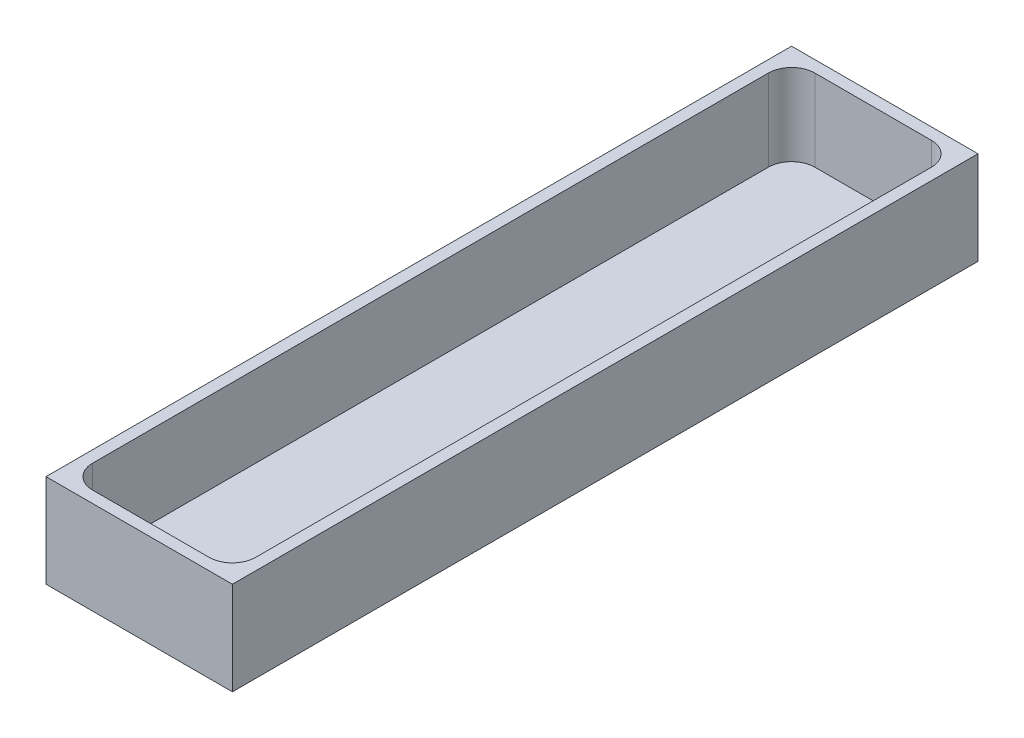
ISO-10303-21;
HEADER;
FILE_DESCRIPTION(('STEP AP214'),'2;1');
FILE_NAME('part.step','',(''),(''),'','','');
FILE_SCHEMA(('AUTOMOTIVE_DESIGN { 1 0 10303 214 1 1 1 1 }'));
ENDSEC;
DATA;
#1=APPLICATION_CONTEXT('core data for automotive mechanical design processes');
#2=APPLICATION_PROTOCOL_DEFINITION('international standard','automotive_design',2000,#1);
#3=PRODUCT_CONTEXT('',#1,'mechanical');
#4=PRODUCT('Part','Part','',(#3));
#5=PRODUCT_RELATED_PRODUCT_CATEGORY('part','',(#4));
#6=PRODUCT_DEFINITION_FORMATION('','',#4);
#7=PRODUCT_DEFINITION_CONTEXT('part definition',#1,'design');
#8=PRODUCT_DEFINITION('design','',#6,#7);
#9=PRODUCT_DEFINITION_SHAPE('','',#8);
#10=(LENGTH_UNIT() NAMED_UNIT(*) SI_UNIT(.MILLI.,.METRE.));
#11=(NAMED_UNIT(*) PLANE_ANGLE_UNIT() SI_UNIT($,.RADIAN.));
#12=(NAMED_UNIT(*) SI_UNIT($,.STERADIAN.) SOLID_ANGLE_UNIT());
#13=UNCERTAINTY_MEASURE_WITH_UNIT(LENGTH_MEASURE(1.E-05),#10,'distance_accuracy_value','');
#14=(GEOMETRIC_REPRESENTATION_CONTEXT(3) GLOBAL_UNCERTAINTY_ASSIGNED_CONTEXT((#13)) GLOBAL_UNIT_ASSIGNED_CONTEXT((#10,
#11,#12)) REPRESENTATION_CONTEXT('',''));
#15=CARTESIAN_POINT('',(0.,0.,0.));
#16=DIRECTION('',(0.,0.,1.));
#17=DIRECTION('',(1.,0.,0.));
#18=AXIS2_PLACEMENT_3D('',#15,#16,#17);
#19=CARTESIAN_POINT('',(0.,25.4,0.));
#20=DIRECTION('',(0.,-1.,0.));
#21=DIRECTION('',(0.,0.,-1.));
#22=AXIS2_PLACEMENT_3D('',#19,#20,#21);
#23=PLANE('',#22);
#24=DIRECTION('',(0.,0.,1.));
#25=VECTOR('',#24,1.);
#26=CARTESIAN_POINT('',(0.,25.4,0.));
#27=LINE('',#26,#25);
#28=CARTESIAN_POINT('',(0.,25.4,-203.2));
#29=VERTEX_POINT('',#28);
#30=CARTESIAN_POINT('',(0.,25.4,0.));
#31=VERTEX_POINT('',#30);
#32=EDGE_CURVE('E134',#29,#31,#27,.T.);
#33=ORIENTED_EDGE('',*,*,#32,.T.);
#34=DIRECTION('',(1.,0.,0.));
#35=VECTOR('',#34,1.);
#36=CARTESIAN_POINT('',(0.,25.4,0.));
#37=LINE('',#36,#35);
#38=CARTESIAN_POINT('',(50.8,25.4,0.));
#39=VERTEX_POINT('',#38);
#40=EDGE_CURVE('E123',#31,#39,#37,.T.);
#41=ORIENTED_EDGE('',*,*,#40,.T.);
#42=DIRECTION('',(0.,0.,-1.));
#43=VECTOR('',#42,1.);
#44=CARTESIAN_POINT('',(50.8,25.4,0.));
#45=LINE('',#44,#43);
#46=CARTESIAN_POINT('',(50.8,25.4,-203.2));
#47=VERTEX_POINT('',#46);
#48=EDGE_CURVE('E133',#39,#47,#45,.T.);
#49=ORIENTED_EDGE('',*,*,#48,.T.);
#50=DIRECTION('',(-1.,0.,0.));
#51=VECTOR('',#50,1.);
#52=CARTESIAN_POINT('',(0.,25.4,-203.2));
#53=LINE('',#52,#51);
#54=EDGE_CURVE('E138',#47,#29,#53,.T.);
#55=ORIENTED_EDGE('',*,*,#54,.T.);
#56=EDGE_LOOP('',(#33,#41,#49,#55));
#57=FACE_BOUND('',#56,.T.);
#58=DIRECTION('',(0.,0.,1.));
#59=VECTOR('',#58,1.);
#60=CARTESIAN_POINT('',(3.175,25.4,0.));
#61=LINE('',#60,#59);
#62=CARTESIAN_POINT('',(3.175,25.4,-193.675));
#63=VERTEX_POINT('',#62);
#64=CARTESIAN_POINT('',(3.175,25.4,-9.525));
#65=VERTEX_POINT('',#64);
#66=EDGE_CURVE('E206',#63,#65,#61,.T.);
#67=ORIENTED_EDGE('',*,*,#66,.F.);
#68=CARTESIAN_POINT('',(9.525,25.4,-193.675));
#69=DIRECTION('',(0.,-1.,0.));
#70=DIRECTION('',(0.,0.,-1.));
#71=AXIS2_PLACEMENT_3D('',#68,#69,#70);
#72=CIRCLE('',#71,6.35);
#73=CARTESIAN_POINT('',(9.525,25.4,-200.025));
#74=VERTEX_POINT('',#73);
#75=EDGE_CURVE('E11',#63,#74,#72,.T.);
#76=ORIENTED_EDGE('',*,*,#75,.T.);
#77=DIRECTION('',(-1.,0.,0.));
#78=VECTOR('',#77,1.);
#79=CARTESIAN_POINT('',(0.,25.4,-200.025));
#80=LINE('',#79,#78);
#81=CARTESIAN_POINT('',(41.275,25.4,-200.025));
#82=VERTEX_POINT('',#81);
#83=EDGE_CURVE('E187',#82,#74,#80,.T.);
#84=ORIENTED_EDGE('',*,*,#83,.F.);
#85=CARTESIAN_POINT('',(41.275,25.4,-193.675));
#86=DIRECTION('',(0.,-1.,0.));
#87=DIRECTION('',(0.,0.,-1.));
#88=AXIS2_PLACEMENT_3D('',#85,#86,#87);
#89=CIRCLE('',#88,6.35);
#90=CARTESIAN_POINT('',(47.625,25.4,-193.675));
#91=VERTEX_POINT('',#90);
#92=EDGE_CURVE('E42',#82,#91,#89,.T.);
#93=ORIENTED_EDGE('',*,*,#92,.T.);
#94=DIRECTION('',(0.,0.,-1.));
#95=VECTOR('',#94,1.);
#96=CARTESIAN_POINT('',(47.625,25.4,0.));
#97=LINE('',#96,#95);
#98=CARTESIAN_POINT('',(47.625,25.4,-9.525));
#99=VERTEX_POINT('',#98);
#100=EDGE_CURVE('E185',#99,#91,#97,.T.);
#101=ORIENTED_EDGE('',*,*,#100,.F.);
#102=CARTESIAN_POINT('',(41.275,25.4,-9.525));
#103=DIRECTION('',(0.,-1.,0.));
#104=DIRECTION('',(0.,0.,-1.));
#105=AXIS2_PLACEMENT_3D('',#102,#103,#104);
#106=CIRCLE('',#105,6.35);
#107=CARTESIAN_POINT('',(41.275,25.4,-3.175));
#108=VERTEX_POINT('',#107);
#109=EDGE_CURVE('E181',#99,#108,#106,.T.);
#110=ORIENTED_EDGE('',*,*,#109,.T.);
#111=DIRECTION('',(1.,0.,0.));
#112=VECTOR('',#111,1.);
#113=CARTESIAN_POINT('',(0.,25.4,-3.175));
#114=LINE('',#113,#112);
#115=CARTESIAN_POINT('',(9.525,25.4,-3.175));
#116=VERTEX_POINT('',#115);
#117=EDGE_CURVE('E195',#116,#108,#114,.T.);
#118=ORIENTED_EDGE('',*,*,#117,.F.);
#119=CARTESIAN_POINT('',(9.525,25.4,-9.525));
#120=DIRECTION('',(0.,-1.,0.));
#121=DIRECTION('',(0.,0.,-1.));
#122=AXIS2_PLACEMENT_3D('',#119,#120,#121);
#123=CIRCLE('',#122,6.35);
#124=EDGE_CURVE('E179',#116,#65,#123,.T.);
#125=ORIENTED_EDGE('',*,*,#124,.T.);
#126=EDGE_LOOP('',(#67,#76,#84,#93,#101,#110,#118,#125));
#127=FACE_BOUND('',#126,.T.);
#128=ADVANCED_FACE('F34',(#57,#127),#23,.F.);
#129=CARTESIAN_POINT('',(0.,25.4,0.));
#130=DIRECTION('',(1.,0.,0.));
#131=DIRECTION('',(0.,0.,-1.));
#132=AXIS2_PLACEMENT_3D('',#129,#130,#131);
#133=PLANE('',#132);
#134=DIRECTION('',(0.,0.,1.));
#135=VECTOR('',#134,1.);
#136=CARTESIAN_POINT('',(0.,0.,0.));
#137=LINE('',#136,#135);
#138=CARTESIAN_POINT('',(0.,0.,-203.2));
#139=VERTEX_POINT('',#138);
#140=CARTESIAN_POINT('',(0.,0.,0.));
#141=VERTEX_POINT('',#140);
#142=EDGE_CURVE('E146',#139,#141,#137,.T.);
#143=ORIENTED_EDGE('',*,*,#142,.T.);
#144=DIRECTION('',(0.,-1.,0.));
#145=VECTOR('',#144,1.);
#146=CARTESIAN_POINT('',(0.,25.4,0.));
#147=LINE('',#146,#145);
#148=EDGE_CURVE('E127',#31,#141,#147,.T.);
#149=ORIENTED_EDGE('',*,*,#148,.F.);
#150=ORIENTED_EDGE('',*,*,#32,.F.);
#151=DIRECTION('',(0.,-1.,0.));
#152=VECTOR('',#151,1.);
#153=CARTESIAN_POINT('',(0.,25.4,-203.2));
#154=LINE('',#153,#152);
#155=EDGE_CURVE('E219',#29,#139,#154,.T.);
#156=ORIENTED_EDGE('',*,*,#155,.T.);
#157=EDGE_LOOP('',(#143,#149,#150,#156));
#158=FACE_BOUND('',#157,.T.);
#159=ADVANCED_FACE('F144',(#158),#133,.F.);
#160=CARTESIAN_POINT('',(0.,25.4,0.));
#161=DIRECTION('',(0.,0.,-1.));
#162=DIRECTION('',(-1.,0.,0.));
#163=AXIS2_PLACEMENT_3D('',#160,#161,#162);
#164=PLANE('',#163);
#165=DIRECTION('',(1.,0.,0.));
#166=VECTOR('',#165,1.);
#167=CARTESIAN_POINT('',(0.,0.,0.));
#168=LINE('',#167,#166);
#169=CARTESIAN_POINT('',(50.8,0.,0.));
#170=VERTEX_POINT('',#169);
#171=EDGE_CURVE('E221',#141,#170,#168,.T.);
#172=ORIENTED_EDGE('',*,*,#171,.T.);
#173=DIRECTION('',(0.,-1.,0.));
#174=VECTOR('',#173,1.);
#175=CARTESIAN_POINT('',(50.8,25.4,0.));
#176=LINE('',#175,#174);
#177=EDGE_CURVE('E130',#39,#170,#176,.T.);
#178=ORIENTED_EDGE('',*,*,#177,.F.);
#179=ORIENTED_EDGE('',*,*,#40,.F.);
#180=ORIENTED_EDGE('',*,*,#148,.T.);
#181=EDGE_LOOP('',(#172,#178,#179,#180));
#182=FACE_BOUND('',#181,.T.);
#183=ADVANCED_FACE('F125',(#182),#164,.F.);
#184=CARTESIAN_POINT('',(50.8,25.4,0.));
#185=DIRECTION('',(-1.,0.,0.));
#186=DIRECTION('',(0.,0.,1.));
#187=AXIS2_PLACEMENT_3D('',#184,#185,#186);
#188=PLANE('',#187);
#189=DIRECTION('',(0.,0.,-1.));
#190=VECTOR('',#189,1.);
#191=CARTESIAN_POINT('',(50.8,0.,0.));
#192=LINE('',#191,#190);
#193=CARTESIAN_POINT('',(50.8,0.,-203.2));
#194=VERTEX_POINT('',#193);
#195=EDGE_CURVE('E223',#170,#194,#192,.T.);
#196=ORIENTED_EDGE('',*,*,#195,.T.);
#197=DIRECTION('',(0.,-1.,0.));
#198=VECTOR('',#197,1.);
#199=CARTESIAN_POINT('',(50.8,25.4,-203.2));
#200=LINE('',#199,#198);
#201=EDGE_CURVE('E151',#47,#194,#200,.T.);
#202=ORIENTED_EDGE('',*,*,#201,.F.);
#203=ORIENTED_EDGE('',*,*,#48,.F.);
#204=ORIENTED_EDGE('',*,*,#177,.T.);
#205=EDGE_LOOP('',(#196,#202,#203,#204));
#206=FACE_BOUND('',#205,.T.);
#207=ADVANCED_FACE('F235',(#206),#188,.F.);
#208=CARTESIAN_POINT('',(0.,25.4,-203.2));
#209=DIRECTION('',(0.,0.,1.));
#210=DIRECTION('',(1.,0.,0.));
#211=AXIS2_PLACEMENT_3D('',#208,#209,#210);
#212=PLANE('',#211);
#213=DIRECTION('',(-1.,0.,0.));
#214=VECTOR('',#213,1.);
#215=CARTESIAN_POINT('',(0.,0.,-203.2));
#216=LINE('',#215,#214);
#217=EDGE_CURVE('E142',#194,#139,#216,.T.);
#218=ORIENTED_EDGE('',*,*,#217,.T.);
#219=ORIENTED_EDGE('',*,*,#155,.F.);
#220=ORIENTED_EDGE('',*,*,#54,.F.);
#221=ORIENTED_EDGE('',*,*,#201,.T.);
#222=EDGE_LOOP('',(#218,#219,#220,#221));
#223=FACE_BOUND('',#222,.T.);
#224=ADVANCED_FACE('F230',(#223),#212,.F.);
#225=CARTESIAN_POINT('',(0.,0.,0.));
#226=DIRECTION('',(0.,-1.,0.));
#227=DIRECTION('',(0.,0.,-1.));
#228=AXIS2_PLACEMENT_3D('',#225,#226,#227);
#229=PLANE('',#228);
#230=ORIENTED_EDGE('',*,*,#142,.F.);
#231=ORIENTED_EDGE('',*,*,#217,.F.);
#232=ORIENTED_EDGE('',*,*,#195,.F.);
#233=ORIENTED_EDGE('',*,*,#171,.F.);
#234=EDGE_LOOP('',(#230,#231,#232,#233));
#235=FACE_BOUND('',#234,.T.);
#236=ADVANCED_FACE('F234',(#235),#229,.T.);
#237=CARTESIAN_POINT('',(3.175,25.4,0.));
#238=DIRECTION('',(1.,0.,0.));
#239=DIRECTION('',(0.,0.,-1.));
#240=AXIS2_PLACEMENT_3D('',#237,#238,#239);
#241=PLANE('',#240);
#242=ORIENTED_EDGE('',*,*,#66,.T.);
#243=DIRECTION('',(0.,-1.,0.));
#244=VECTOR('',#243,1.);
#245=CARTESIAN_POINT('',(3.175,3.175,-9.525));
#246=LINE('',#245,#244);
#247=CARTESIAN_POINT('',(3.175,3.175,-9.525));
#248=VERTEX_POINT('',#247);
#249=EDGE_CURVE('E149',#65,#248,#246,.T.);
#250=ORIENTED_EDGE('',*,*,#249,.T.);
#251=DIRECTION('',(0.,0.,1.));
#252=VECTOR('',#251,1.);
#253=CARTESIAN_POINT('',(3.175,3.175,0.));
#254=LINE('',#253,#252);
#255=CARTESIAN_POINT('',(3.175,3.175,-193.675));
#256=VERTEX_POINT('',#255);
#257=EDGE_CURVE('E294',#256,#248,#254,.T.);
#258=ORIENTED_EDGE('',*,*,#257,.F.);
#259=DIRECTION('',(0.,-1.,0.));
#260=VECTOR('',#259,1.);
#261=CARTESIAN_POINT('',(3.175,25.4,-193.675));
#262=LINE('',#261,#260);
#263=EDGE_CURVE('E147',#256,#63,#262,.F.);
#264=ORIENTED_EDGE('',*,*,#263,.T.);
#265=EDGE_LOOP('',(#242,#250,#258,#264));
#266=FACE_BOUND('',#265,.T.);
#267=ADVANCED_FACE('F254',(#266),#241,.T.);
#268=CARTESIAN_POINT('',(0.,25.4,-3.175));
#269=DIRECTION('',(0.,0.,-1.));
#270=DIRECTION('',(-1.,0.,0.));
#271=AXIS2_PLACEMENT_3D('',#268,#269,#270);
#272=PLANE('',#271);
#273=DIRECTION('',(1.,0.,0.));
#274=VECTOR('',#273,1.);
#275=CARTESIAN_POINT('',(0.,3.175,-3.175));
#276=LINE('',#275,#274);
#277=CARTESIAN_POINT('',(9.525,3.175,-3.175));
#278=VERTEX_POINT('',#277);
#279=CARTESIAN_POINT('',(41.275,3.175,-3.175));
#280=VERTEX_POINT('',#279);
#281=EDGE_CURVE('E210',#278,#280,#276,.T.);
#282=ORIENTED_EDGE('',*,*,#281,.F.);
#283=DIRECTION('',(0.,-1.,0.));
#284=VECTOR('',#283,1.);
#285=CARTESIAN_POINT('',(9.525,25.4,-3.175));
#286=LINE('',#285,#284);
#287=EDGE_CURVE('E168',#278,#116,#286,.F.);
#288=ORIENTED_EDGE('',*,*,#287,.T.);
#289=ORIENTED_EDGE('',*,*,#117,.T.);
#290=DIRECTION('',(0.,-1.,0.));
#291=VECTOR('',#290,1.);
#292=CARTESIAN_POINT('',(41.275,3.175,-3.175));
#293=LINE('',#292,#291);
#294=EDGE_CURVE('E165',#108,#280,#293,.T.);
#295=ORIENTED_EDGE('',*,*,#294,.T.);
#296=EDGE_LOOP('',(#282,#288,#289,#295));
#297=FACE_BOUND('',#296,.T.);
#298=ADVANCED_FACE('F258',(#297),#272,.T.);
#299=CARTESIAN_POINT('',(47.625,25.4,0.));
#300=DIRECTION('',(-1.,0.,0.));
#301=DIRECTION('',(0.,0.,1.));
#302=AXIS2_PLACEMENT_3D('',#299,#300,#301);
#303=PLANE('',#302);
#304=DIRECTION('',(0.,0.,-1.));
#305=VECTOR('',#304,1.);
#306=CARTESIAN_POINT('',(47.625,3.175,0.));
#307=LINE('',#306,#305);
#308=CARTESIAN_POINT('',(47.625,3.175,-9.525));
#309=VERTEX_POINT('',#308);
#310=CARTESIAN_POINT('',(47.625,3.175,-193.675));
#311=VERTEX_POINT('',#310);
#312=EDGE_CURVE('E203',#309,#311,#307,.T.);
#313=ORIENTED_EDGE('',*,*,#312,.F.);
#314=DIRECTION('',(0.,-1.,0.));
#315=VECTOR('',#314,1.);
#316=CARTESIAN_POINT('',(47.625,25.4,-9.525));
#317=LINE('',#316,#315);
#318=EDGE_CURVE('E173',#309,#99,#317,.F.);
#319=ORIENTED_EDGE('',*,*,#318,.T.);
#320=ORIENTED_EDGE('',*,*,#100,.T.);
#321=DIRECTION('',(0.,-1.,0.));
#322=VECTOR('',#321,1.);
#323=CARTESIAN_POINT('',(47.625,3.175,-193.675));
#324=LINE('',#323,#322);
#325=EDGE_CURVE('E170',#91,#311,#324,.T.);
#326=ORIENTED_EDGE('',*,*,#325,.T.);
#327=EDGE_LOOP('',(#313,#319,#320,#326));
#328=FACE_BOUND('',#327,.T.);
#329=ADVANCED_FACE('F192',(#328),#303,.T.);
#330=CARTESIAN_POINT('',(0.,25.4,-200.025));
#331=DIRECTION('',(0.,0.,1.));
#332=DIRECTION('',(1.,0.,0.));
#333=AXIS2_PLACEMENT_3D('',#330,#331,#332);
#334=PLANE('',#333);
#335=DIRECTION('',(-1.,0.,0.));
#336=VECTOR('',#335,1.);
#337=CARTESIAN_POINT('',(0.,3.175,-200.025));
#338=LINE('',#337,#336);
#339=CARTESIAN_POINT('',(41.275,3.175,-200.025));
#340=VERTEX_POINT('',#339);
#341=CARTESIAN_POINT('',(9.525,3.175,-200.025));
#342=VERTEX_POINT('',#341);
#343=EDGE_CURVE('E202',#340,#342,#338,.T.);
#344=ORIENTED_EDGE('',*,*,#343,.F.);
#345=DIRECTION('',(0.,-1.,0.));
#346=VECTOR('',#345,1.);
#347=CARTESIAN_POINT('',(41.275,25.4,-200.025));
#348=LINE('',#347,#346);
#349=EDGE_CURVE('E54',#340,#82,#348,.F.);
#350=ORIENTED_EDGE('',*,*,#349,.T.);
#351=ORIENTED_EDGE('',*,*,#83,.T.);
#352=DIRECTION('',(0.,-1.,0.));
#353=VECTOR('',#352,1.);
#354=CARTESIAN_POINT('',(9.525,3.175,-200.025));
#355=LINE('',#354,#353);
#356=EDGE_CURVE('E175',#74,#342,#355,.T.);
#357=ORIENTED_EDGE('',*,*,#356,.T.);
#358=EDGE_LOOP('',(#344,#350,#351,#357));
#359=FACE_BOUND('',#358,.T.);
#360=ADVANCED_FACE('F204',(#359),#334,.T.);
#361=CARTESIAN_POINT('',(0.,3.175,0.));
#362=DIRECTION('',(0.,-1.,0.));
#363=DIRECTION('',(0.,0.,-1.));
#364=AXIS2_PLACEMENT_3D('',#361,#362,#363);
#365=PLANE('',#364);
#366=ORIENTED_EDGE('',*,*,#257,.T.);
#367=CARTESIAN_POINT('',(9.525,3.175,-9.525));
#368=DIRECTION('',(0.,-1.,0.));
#369=DIRECTION('',(0.,0.,-1.));
#370=AXIS2_PLACEMENT_3D('',#367,#368,#369);
#371=CIRCLE('',#370,6.35);
#372=EDGE_CURVE('E163',#248,#278,#371,.F.);
#373=ORIENTED_EDGE('',*,*,#372,.T.);
#374=ORIENTED_EDGE('',*,*,#281,.T.);
#375=CARTESIAN_POINT('',(41.275,3.175,-9.525));
#376=DIRECTION('',(0.,-1.,0.));
#377=DIRECTION('',(0.,0.,-1.));
#378=AXIS2_PLACEMENT_3D('',#375,#376,#377);
#379=CIRCLE('',#378,6.35);
#380=EDGE_CURVE('E161',#280,#309,#379,.F.);
#381=ORIENTED_EDGE('',*,*,#380,.T.);
#382=ORIENTED_EDGE('',*,*,#312,.T.);
#383=CARTESIAN_POINT('',(41.275,3.175,-193.675));
#384=DIRECTION('',(0.,-1.,0.));
#385=DIRECTION('',(0.,0.,-1.));
#386=AXIS2_PLACEMENT_3D('',#383,#384,#385);
#387=CIRCLE('',#386,6.35);
#388=EDGE_CURVE('E159',#311,#340,#387,.F.);
#389=ORIENTED_EDGE('',*,*,#388,.T.);
#390=ORIENTED_EDGE('',*,*,#343,.T.);
#391=CARTESIAN_POINT('',(9.525,3.175,-193.675));
#392=DIRECTION('',(0.,-1.,0.));
#393=DIRECTION('',(0.,0.,-1.));
#394=AXIS2_PLACEMENT_3D('',#391,#392,#393);
#395=CIRCLE('',#394,6.35);
#396=EDGE_CURVE('E157',#342,#256,#395,.F.);
#397=ORIENTED_EDGE('',*,*,#396,.T.);
#398=EDGE_LOOP('',(#366,#373,#374,#381,#382,#389,#390,#397));
#399=FACE_BOUND('',#398,.T.);
#400=ADVANCED_FACE('F201',(#399),#365,.F.);
#401=CARTESIAN_POINT('',(9.525,25.4,-9.525));
#402=DIRECTION('',(0.,1.,0.));
#403=DIRECTION('',(0.,0.,1.));
#404=AXIS2_PLACEMENT_3D('',#401,#402,#403);
#405=CYLINDRICAL_SURFACE('',#404,6.35);
#406=ORIENTED_EDGE('',*,*,#124,.F.);
#407=ORIENTED_EDGE('',*,*,#287,.F.);
#408=ORIENTED_EDGE('',*,*,#372,.F.);
#409=ORIENTED_EDGE('',*,*,#249,.F.);
#410=EDGE_LOOP('',(#406,#407,#408,#409));
#411=FACE_BOUND('',#410,.T.);
#412=ADVANCED_FACE('F272',(#411),#405,.F.);
#413=CARTESIAN_POINT('',(41.275,25.4,-9.525));
#414=DIRECTION('',(0.,1.,0.));
#415=DIRECTION('',(0.,0.,1.));
#416=AXIS2_PLACEMENT_3D('',#413,#414,#415);
#417=CYLINDRICAL_SURFACE('',#416,6.35);
#418=ORIENTED_EDGE('',*,*,#109,.F.);
#419=ORIENTED_EDGE('',*,*,#318,.F.);
#420=ORIENTED_EDGE('',*,*,#380,.F.);
#421=ORIENTED_EDGE('',*,*,#294,.F.);
#422=EDGE_LOOP('',(#418,#419,#420,#421));
#423=FACE_BOUND('',#422,.T.);
#424=ADVANCED_FACE('F276',(#423),#417,.F.);
#425=CARTESIAN_POINT('',(41.275,25.4,-193.675));
#426=DIRECTION('',(0.,1.,0.));
#427=DIRECTION('',(0.,0.,1.));
#428=AXIS2_PLACEMENT_3D('',#425,#426,#427);
#429=CYLINDRICAL_SURFACE('',#428,6.35);
#430=ORIENTED_EDGE('',*,*,#92,.F.);
#431=ORIENTED_EDGE('',*,*,#349,.F.);
#432=ORIENTED_EDGE('',*,*,#388,.F.);
#433=ORIENTED_EDGE('',*,*,#325,.F.);
#434=EDGE_LOOP('',(#430,#431,#432,#433));
#435=FACE_BOUND('',#434,.T.);
#436=ADVANCED_FACE('F197',(#435),#429,.F.);
#437=CARTESIAN_POINT('',(9.525,25.4,-193.675));
#438=DIRECTION('',(0.,1.,0.));
#439=DIRECTION('',(0.,0.,1.));
#440=AXIS2_PLACEMENT_3D('',#437,#438,#439);
#441=CYLINDRICAL_SURFACE('',#440,6.35);
#442=ORIENTED_EDGE('',*,*,#75,.F.);
#443=ORIENTED_EDGE('',*,*,#263,.F.);
#444=ORIENTED_EDGE('',*,*,#396,.F.);
#445=ORIENTED_EDGE('',*,*,#356,.F.);
#446=EDGE_LOOP('',(#442,#443,#444,#445));
#447=FACE_BOUND('',#446,.T.);
#448=ADVANCED_FACE('F36',(#447),#441,.F.);
#449=CLOSED_SHELL('',(#128,#159,#183,#207,#224,#236,#267,#298,#329,#360,#400,#412,#424,#436,#448));
#450=MANIFOLD_SOLID_BREP('B2',#449);
#451=ADVANCED_BREP_SHAPE_REPRESENTATION('',(#18,#450),#14);
#452=SHAPE_DEFINITION_REPRESENTATION(#9,#451);
ENDSEC;
END-ISO-10303-21;
